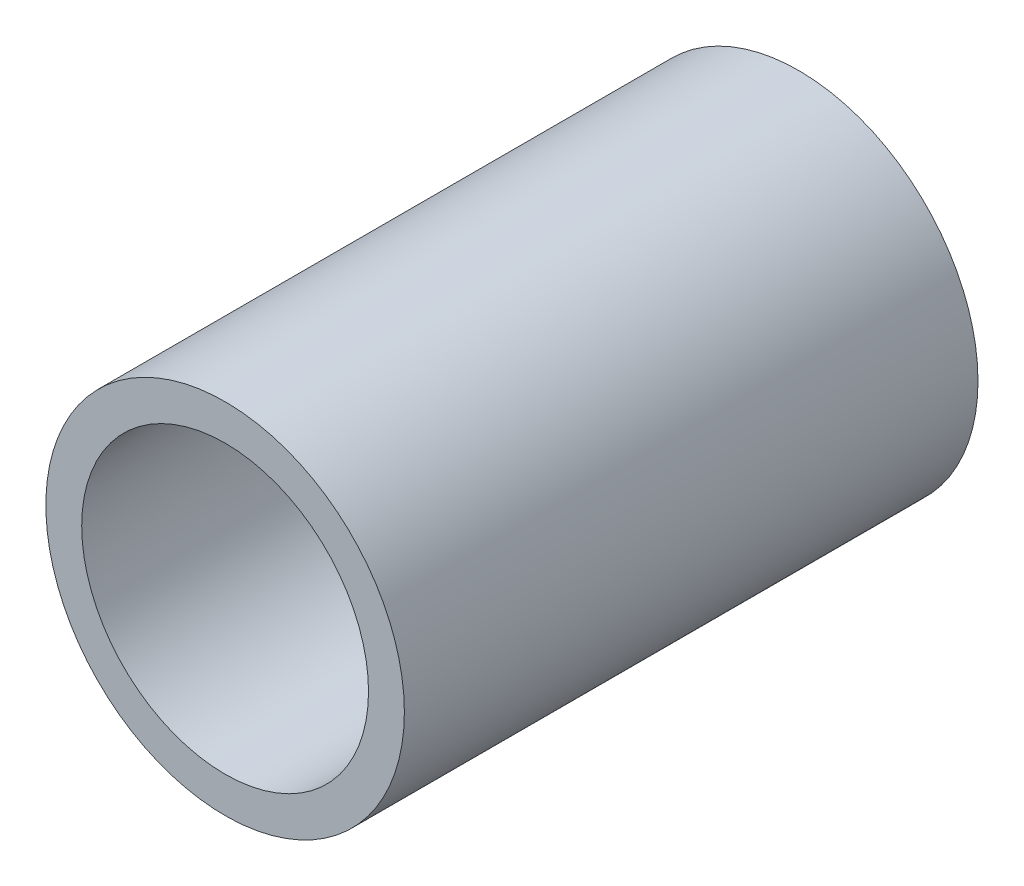
ISO-10303-21;
HEADER;
FILE_DESCRIPTION(('STEP AP214'),'2;1');
FILE_NAME('part.step','',(''),(''),'','','');
FILE_SCHEMA(('AUTOMOTIVE_DESIGN { 1 0 10303 214 1 1 1 1 }'));
ENDSEC;
DATA;
#1=APPLICATION_CONTEXT('core data for automotive mechanical design processes');
#2=APPLICATION_PROTOCOL_DEFINITION('international standard','automotive_design',2000,#1);
#3=PRODUCT_CONTEXT('',#1,'mechanical');
#4=PRODUCT('Part','Part','',(#3));
#5=PRODUCT_RELATED_PRODUCT_CATEGORY('part','',(#4));
#6=PRODUCT_DEFINITION_FORMATION('','',#4);
#7=PRODUCT_DEFINITION_CONTEXT('part definition',#1,'design');
#8=PRODUCT_DEFINITION('design','',#6,#7);
#9=PRODUCT_DEFINITION_SHAPE('','',#8);
#10=(LENGTH_UNIT() NAMED_UNIT(*) SI_UNIT(.MILLI.,.METRE.));
#11=(NAMED_UNIT(*) PLANE_ANGLE_UNIT() SI_UNIT($,.RADIAN.));
#12=(NAMED_UNIT(*) SI_UNIT($,.STERADIAN.) SOLID_ANGLE_UNIT());
#13=UNCERTAINTY_MEASURE_WITH_UNIT(LENGTH_MEASURE(1.E-05),#10,'distance_accuracy_value','');
#14=(GEOMETRIC_REPRESENTATION_CONTEXT(3) GLOBAL_UNCERTAINTY_ASSIGNED_CONTEXT((#13)) GLOBAL_UNIT_ASSIGNED_CONTEXT((#10,
#11,#12)) REPRESENTATION_CONTEXT('',''));
#15=CARTESIAN_POINT('',(0.,0.,0.));
#16=DIRECTION('',(0.,0.,1.));
#17=DIRECTION('',(1.,0.,0.));
#18=AXIS2_PLACEMENT_3D('',#15,#16,#17);
#19=CARTESIAN_POINT('',(0.,0.,-12.7));
#20=DIRECTION('',(0.,0.,-1.));
#21=DIRECTION('',(1.,0.,0.));
#22=AXIS2_PLACEMENT_3D('',#19,#20,#21);
#23=PLANE('',#22);
#24=CARTESIAN_POINT('',(0.,0.,-12.7));
#25=DIRECTION('',(0.,0.,1.));
#26=DIRECTION('',(1.,0.,0.));
#27=AXIS2_PLACEMENT_3D('',#24,#25,#26);
#28=CIRCLE('',#27,3.96875);
#29=CARTESIAN_POINT('',(3.96875,0.,-12.7));
#30=VERTEX_POINT('',#29);
#31=EDGE_CURVE('E10',#30,#30,#28,.T.);
#32=ORIENTED_EDGE('',*,*,#31,.F.);
#33=EDGE_LOOP('',(#32));
#34=FACE_BOUND('',#33,.T.);
#35=CARTESIAN_POINT('',(0.,0.,-12.7));
#36=DIRECTION('',(0.,0.,1.));
#37=DIRECTION('',(1.,0.,0.));
#38=AXIS2_PLACEMENT_3D('',#35,#36,#37);
#39=CIRCLE('',#38,3.175);
#40=CARTESIAN_POINT('',(3.175,0.,-12.7));
#41=VERTEX_POINT('',#40);
#42=EDGE_CURVE('E41',#41,#41,#39,.T.);
#43=ORIENTED_EDGE('',*,*,#42,.T.);
#44=EDGE_LOOP('',(#43));
#45=FACE_BOUND('',#44,.T.);
#46=ADVANCED_FACE('F30',(#34,#45),#23,.T.);
#47=CARTESIAN_POINT('',(0.,0.,0.));
#48=DIRECTION('',(0.,0.,-1.));
#49=DIRECTION('',(1.,0.,0.));
#50=AXIS2_PLACEMENT_3D('',#47,#48,#49);
#51=PLANE('',#50);
#52=CARTESIAN_POINT('',(0.,0.,0.));
#53=DIRECTION('',(0.,0.,1.));
#54=DIRECTION('',(1.,0.,0.));
#55=AXIS2_PLACEMENT_3D('',#52,#53,#54);
#56=CIRCLE('',#55,3.96875);
#57=CARTESIAN_POINT('',(3.96875,0.,0.));
#58=VERTEX_POINT('',#57);
#59=EDGE_CURVE('E34',#58,#58,#56,.T.);
#60=ORIENTED_EDGE('',*,*,#59,.T.);
#61=EDGE_LOOP('',(#60));
#62=FACE_BOUND('',#61,.T.);
#63=CARTESIAN_POINT('',(0.,0.,0.));
#64=DIRECTION('',(0.,0.,1.));
#65=DIRECTION('',(1.,0.,0.));
#66=AXIS2_PLACEMENT_3D('',#63,#64,#65);
#67=CIRCLE('',#66,3.175);
#68=CARTESIAN_POINT('',(3.175,0.,0.));
#69=VERTEX_POINT('',#68);
#70=EDGE_CURVE('E43',#69,#69,#67,.T.);
#71=ORIENTED_EDGE('',*,*,#70,.F.);
#72=EDGE_LOOP('',(#71));
#73=FACE_BOUND('',#72,.T.);
#74=ADVANCED_FACE('F56',(#62,#73),#51,.F.);
#75=CARTESIAN_POINT('',(0.,0.,-12.7));
#76=DIRECTION('',(0.,0.,1.));
#77=DIRECTION('',(-1.,0.,0.));
#78=AXIS2_PLACEMENT_3D('',#75,#76,#77);
#79=CYLINDRICAL_SURFACE('',#78,3.96875);
#80=ORIENTED_EDGE('',*,*,#31,.T.);
#81=EDGE_LOOP('',(#80));
#82=FACE_BOUND('',#81,.T.);
#83=ORIENTED_EDGE('',*,*,#59,.F.);
#84=EDGE_LOOP('',(#83));
#85=FACE_BOUND('',#84,.T.);
#86=ADVANCED_FACE('F32',(#82,#85),#79,.T.);
#87=CARTESIAN_POINT('',(0.,0.,-12.7));
#88=DIRECTION('',(0.,0.,1.));
#89=DIRECTION('',(-1.,0.,0.));
#90=AXIS2_PLACEMENT_3D('',#87,#88,#89);
#91=CYLINDRICAL_SURFACE('',#90,3.175);
#92=ORIENTED_EDGE('',*,*,#42,.F.);
#93=EDGE_LOOP('',(#92));
#94=FACE_BOUND('',#93,.T.);
#95=ORIENTED_EDGE('',*,*,#70,.T.);
#96=EDGE_LOOP('',(#95));
#97=FACE_BOUND('',#96,.T.);
#98=ADVANCED_FACE('F50',(#94,#97),#91,.F.);
#99=CLOSED_SHELL('',(#46,#74,#86,#98));
#100=MANIFOLD_SOLID_BREP('B2',#99);
#101=ADVANCED_BREP_SHAPE_REPRESENTATION('',(#18,#100),#14);
#102=SHAPE_DEFINITION_REPRESENTATION(#9,#101);
ENDSEC;
END-ISO-10303-21;
